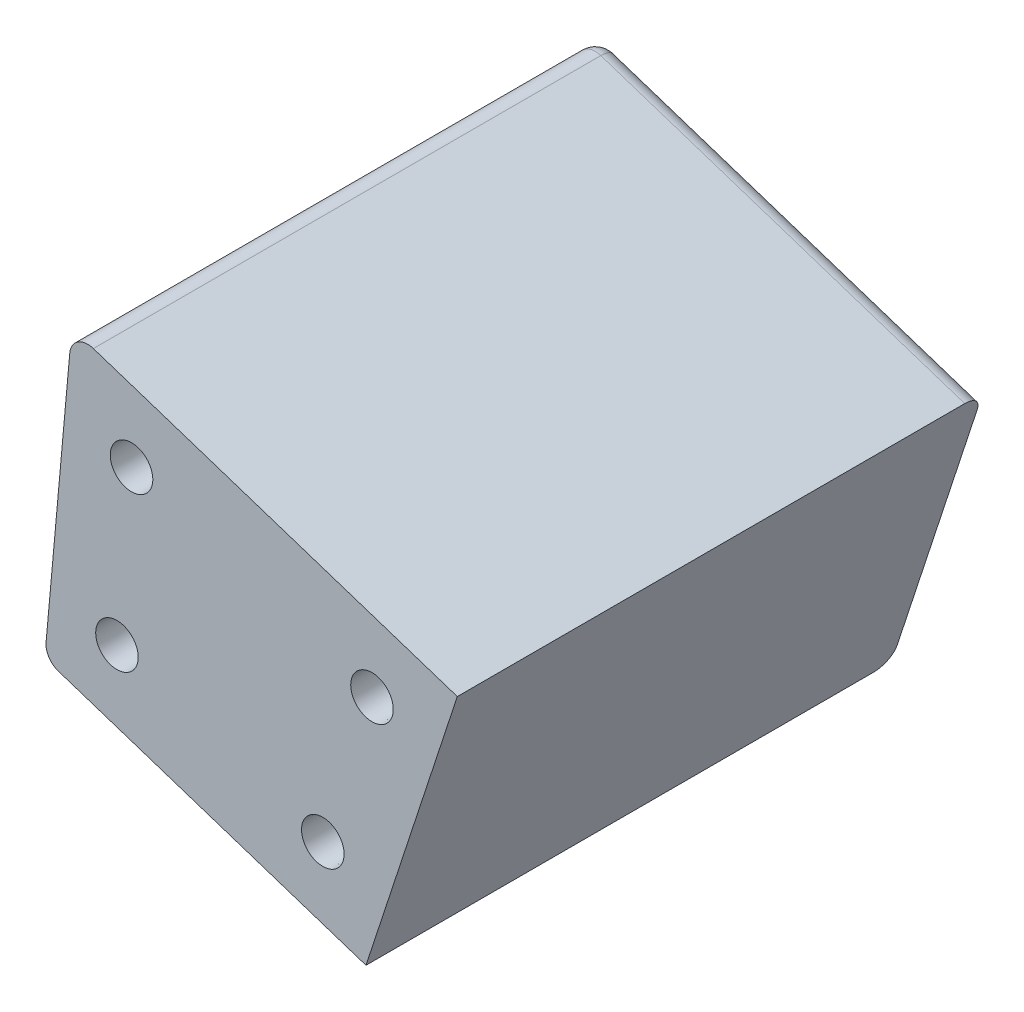
ISO-10303-21;
HEADER;
FILE_DESCRIPTION(('STEP AP214'),'2;1');
FILE_NAME('part.step','',(''),(''),'','','');
FILE_SCHEMA(('AUTOMOTIVE_DESIGN { 1 0 10303 214 1 1 1 1 }'));
ENDSEC;
DATA;
#1=APPLICATION_CONTEXT('core data for automotive mechanical design processes');
#2=APPLICATION_PROTOCOL_DEFINITION('international standard','automotive_design',2000,#1);
#3=PRODUCT_CONTEXT('',#1,'mechanical');
#4=PRODUCT('Part','Part','',(#3));
#5=PRODUCT_RELATED_PRODUCT_CATEGORY('part','',(#4));
#6=PRODUCT_DEFINITION_FORMATION('','',#4);
#7=PRODUCT_DEFINITION_CONTEXT('part definition',#1,'design');
#8=PRODUCT_DEFINITION('design','',#6,#7);
#9=PRODUCT_DEFINITION_SHAPE('','',#8);
#10=(LENGTH_UNIT() NAMED_UNIT(*) SI_UNIT(.MILLI.,.METRE.));
#11=(NAMED_UNIT(*) PLANE_ANGLE_UNIT() SI_UNIT($,.RADIAN.));
#12=(NAMED_UNIT(*) SI_UNIT($,.STERADIAN.) SOLID_ANGLE_UNIT());
#13=UNCERTAINTY_MEASURE_WITH_UNIT(LENGTH_MEASURE(1.E-05),#10,'distance_accuracy_value','');
#14=(GEOMETRIC_REPRESENTATION_CONTEXT(3) GLOBAL_UNCERTAINTY_ASSIGNED_CONTEXT((#13)) GLOBAL_UNIT_ASSIGNED_CONTEXT((#10,
#11,#12)) REPRESENTATION_CONTEXT('',''));
#15=CARTESIAN_POINT('',(0.,0.,0.));
#16=DIRECTION('',(0.,0.,1.));
#17=DIRECTION('',(1.,0.,0.));
#18=AXIS2_PLACEMENT_3D('',#15,#16,#17);
#19=CARTESIAN_POINT('',(322.852981493589,359.973302076131,-320.548936371749));
#20=DIRECTION('',(0.311692939950405,0.950182883020467,0.));
#21=DIRECTION('',(-0.950182883020467,0.311692939950405,0.));
#22=AXIS2_PLACEMENT_3D('',#19,#20,#21);
#23=PLANE('',#22);
#24=DIRECTION('',(0.950182883020467,-0.311692939950405,0.));
#25=VECTOR('',#24,1.);
#26=CARTESIAN_POINT('',(277.604402796012,374.81640520381,-71.4850000029993));
#27=LINE('',#26,#25);
#28=CARTESIAN_POINT('',(322.852981493589,359.973302076132,-71.4850000029993));
#29=VERTEX_POINT('',#28);
#30=CARTESIAN_POINT('',(279.524159161108,374.18665853491,-71.4850000029994));
#31=VERTEX_POINT('',#30);
#32=EDGE_CURVE('E178',#29,#31,#27,.F.);
#33=ORIENTED_EDGE('',*,*,#32,.F.);
#34=DIRECTION('',(0.,0.,1.));
#35=VECTOR('',#34,1.);
#36=CARTESIAN_POINT('',(322.852981493589,359.973302076131,-320.548936371749));
#37=LINE('',#36,#35);
#38=CARTESIAN_POINT('',(322.852981493587,359.973302076131,0.));
#39=VERTEX_POINT('',#38);
#40=EDGE_CURVE('E171',#29,#39,#37,.T.);
#41=ORIENTED_EDGE('',*,*,#40,.T.);
#42=DIRECTION('',(0.950182883020467,-0.311692939950405,0.));
#43=VECTOR('',#42,1.);
#44=CARTESIAN_POINT('',(322.852981493587,359.973302076131,0.));
#45=LINE('',#44,#43);
#46=CARTESIAN_POINT('',(279.524159161109,374.186658534908,0.));
#47=VERTEX_POINT('',#46);
#48=EDGE_CURVE('E172',#47,#39,#45,.T.);
#49=ORIENTED_EDGE('',*,*,#48,.F.);
#50=DIRECTION('',(0.,0.,1.));
#51=VECTOR('',#50,1.);
#52=CARTESIAN_POINT('',(279.524159161109,374.186658534908,-320.548936371748));
#53=LINE('',#52,#51);
#54=EDGE_CURVE('E185',#31,#47,#53,.T.);
#55=ORIENTED_EDGE('',*,*,#54,.F.);
#56=EDGE_LOOP('',(#33,#41,#49,#55));
#57=FACE_BOUND('',#56,.T.);
#58=ADVANCED_FACE('F35',(#57),#23,.F.);
#59=CARTESIAN_POINT('',(335.718107590044,399.1921005728,-320.548936371745));
#60=DIRECTION('',(-0.950182883020467,0.311692939950405,0.));
#61=DIRECTION('',(-0.311692939950405,-0.950182883020467,0.));
#62=AXIS2_PLACEMENT_3D('',#59,#60,#61);
#63=PLANE('',#62);
#64=DIRECTION('',(0.311692939950405,0.950182883020467,0.));
#65=VECTOR('',#64,1.);
#66=CARTESIAN_POINT('',(335.718107590041,399.1921005728,-74.0250000029995));
#67=LINE('',#66,#65);
#68=CARTESIAN_POINT('',(323.64468156106,362.386766599006,-74.0250000029995));
#69=VERTEX_POINT('',#68);
#70=CARTESIAN_POINT('',(334.926407522564,396.778636049931,-74.0250000029991));
#71=VERTEX_POINT('',#70);
#72=EDGE_CURVE('E163',#69,#71,#67,.T.);
#73=ORIENTED_EDGE('',*,*,#72,.T.);
#74=CARTESIAN_POINT('',(334.926407522567,396.778636049931,-71.4850000029991));
#75=DIRECTION('',(0.950182883020467,-0.311692939950405,0.));
#76=DIRECTION('',(-0.311692939950405,-0.950182883020467,0.));
#77=AXIS2_PLACEMENT_3D('',#74,#75,#76);
#78=CIRCLE('',#77,2.54);
#79=CARTESIAN_POINT('',(335.718107590046,399.192100572801,-71.4850000029995));
#80=VERTEX_POINT('',#79);
#81=EDGE_CURVE('E208',#80,#71,#78,.F.);
#82=ORIENTED_EDGE('',*,*,#81,.F.);
#83=DIRECTION('',(0.,0.,1.));
#84=VECTOR('',#83,1.);
#85=CARTESIAN_POINT('',(335.718107590044,399.1921005728,-320.548936371745));
#86=LINE('',#85,#84);
#87=CARTESIAN_POINT('',(335.718107590044,399.192100572799,4.16333634234434E-13));
#88=VERTEX_POINT('',#87);
#89=EDGE_CURVE('E167',#80,#88,#86,.T.);
#90=ORIENTED_EDGE('',*,*,#89,.T.);
#91=DIRECTION('',(0.311692939950405,0.950182883020467,0.));
#92=VECTOR('',#91,1.);
#93=CARTESIAN_POINT('',(335.718107590044,399.192100572799,4.16333634234434E-13));
#94=LINE('',#93,#92);
#95=EDGE_CURVE('E168',#39,#88,#94,.T.);
#96=ORIENTED_EDGE('',*,*,#95,.F.);
#97=ORIENTED_EDGE('',*,*,#40,.F.);
#98=CARTESIAN_POINT('',(323.644681561065,362.386766599006,-71.4850000029995));
#99=DIRECTION('',(0.950182883020467,-0.311692939950405,0.));
#100=DIRECTION('',(-0.311692939950405,-0.950182883020467,0.));
#101=AXIS2_PLACEMENT_3D('',#98,#99,#100);
#102=CIRCLE('',#101,2.54);
#103=EDGE_CURVE('E210',#69,#29,#102,.F.);
#104=ORIENTED_EDGE('',*,*,#103,.F.);
#105=EDGE_LOOP('',(#73,#82,#90,#96,#97,#104));
#106=FACE_BOUND('',#105,.T.);
#107=ADVANCED_FACE('F265',(#106),#63,.F.);
#108=CARTESIAN_POINT('',(281.415155825423,417.005352090966,-320.548936371747));
#109=DIRECTION('',(-0.311692939950405,-0.950182883020467,0.));
#110=DIRECTION('',(0.950182883020467,-0.311692939950405,0.));
#111=AXIS2_PLACEMENT_3D('',#108,#109,#110);
#112=PLANE('',#111);
#113=DIRECTION('',(0.,0.,1.));
#114=VECTOR('',#113,1.);
#115=CARTESIAN_POINT('',(284.449296568006,416.010048697085,-320.548936371747));
#116=LINE('',#115,#114);
#117=CARTESIAN_POINT('',(284.449296568005,416.010048697085,5.55111512312578E-13));
#118=VERTEX_POINT('',#117);
#119=CARTESIAN_POINT('',(284.449296568006,416.010048697086,-71.4850000029985));
#120=VERTEX_POINT('',#119);
#121=EDGE_CURVE('E44',#118,#120,#116,.F.);
#122=ORIENTED_EDGE('',*,*,#121,.F.);
#123=DIRECTION('',(-0.950182883020467,0.311692939950405,0.));
#124=VECTOR('',#123,1.);
#125=CARTESIAN_POINT('',(281.415155825424,417.005352090967,0.));
#126=LINE('',#125,#124);
#127=EDGE_CURVE('E164',#88,#118,#126,.T.);
#128=ORIENTED_EDGE('',*,*,#127,.F.);
#129=ORIENTED_EDGE('',*,*,#89,.F.);
#130=DIRECTION('',(-0.950182883020467,0.311692939950405,0.));
#131=VECTOR('',#130,1.);
#132=CARTESIAN_POINT('',(335.718107590046,399.192100572801,-71.4850000029995));
#133=LINE('',#132,#131);
#134=EDGE_CURVE('E11',#120,#80,#133,.F.);
#135=ORIENTED_EDGE('',*,*,#134,.F.);
#136=EDGE_LOOP('',(#122,#128,#129,#135));
#137=FACE_BOUND('',#136,.T.);
#138=ADVANCED_FACE('F270',(#137),#112,.F.);
#139=CARTESIAN_POINT('',(277.604402796012,374.816405203807,-320.548936371748));
#140=DIRECTION('',(0.995945412759858,-0.0899596287376289,0.));
#141=DIRECTION('',(0.0899596287376289,0.995945412759858,0.));
#142=AXIS2_PLACEMENT_3D('',#139,#140,#141);
#143=PLANE('',#142);
#144=DIRECTION('',(-0.0899596287376289,-0.995945412759858,0.));
#145=VECTOR('',#144,1.);
#146=CARTESIAN_POINT('',(277.60440279601,374.816405203807,5.82867087928207E-13));
#147=LINE('',#146,#145);
#148=CARTESIAN_POINT('',(281.127895152116,413.825081631207,5.55111512312578E-13));
#149=VERTEX_POINT('',#148);
#150=CARTESIAN_POINT('',(277.786157880173,376.828620514775,5.55111512312578E-13));
#151=VERTEX_POINT('',#150);
#152=EDGE_CURVE('E160',#149,#151,#147,.T.);
#153=ORIENTED_EDGE('',*,*,#152,.F.);
#154=DIRECTION('',(0.,0.,1.));
#155=VECTOR('',#154,1.);
#156=CARTESIAN_POINT('',(281.127895152116,413.825081631207,-320.548936371747));
#157=LINE('',#156,#155);
#158=CARTESIAN_POINT('',(281.127895152118,413.825081631208,-71.4850000029985));
#159=VERTEX_POINT('',#158);
#160=EDGE_CURVE('E192',#159,#149,#157,.T.);
#161=ORIENTED_EDGE('',*,*,#160,.F.);
#162=DIRECTION('',(-0.0899596287376289,-0.995945412759858,0.));
#163=VECTOR('',#162,1.);
#164=CARTESIAN_POINT('',(281.415155825424,417.005352090969,-71.4850000029985));
#165=LINE('',#164,#163);
#166=CARTESIAN_POINT('',(277.786157880175,376.828620514777,-71.4850000030002));
#167=VERTEX_POINT('',#166);
#168=EDGE_CURVE('E195',#167,#159,#165,.F.);
#169=ORIENTED_EDGE('',*,*,#168,.F.);
#170=DIRECTION('',(0.,0.,1.));
#171=VECTOR('',#170,1.);
#172=CARTESIAN_POINT('',(277.786157880174,376.828620514776,-320.548936371748));
#173=LINE('',#172,#171);
#174=EDGE_CURVE('E198',#151,#167,#173,.F.);
#175=ORIENTED_EDGE('',*,*,#174,.F.);
#176=EDGE_LOOP('',(#153,#161,#169,#175));
#177=FACE_BOUND('',#176,.T.);
#178=ADVANCED_FACE('F251',(#177),#143,.F.);
#179=CARTESIAN_POINT('',(0.,0.,0.));
#180=DIRECTION('',(0.,0.,-1.));
#181=DIRECTION('',(1.00000000000001,0.,0.));
#182=AXIS2_PLACEMENT_3D('',#179,#180,#181);
#183=PLANE('',#182);
#184=CARTESIAN_POINT('',(323.698740376241,393.110483865059,5.55111512312578E-13));
#185=DIRECTION('',(0.,0.,-1.));
#186=DIRECTION('',(-1.00000000000001,0.,0.));
#187=AXIS2_PLACEMENT_3D('',#184,#185,#186);
#188=CIRCLE('',#187,2.99720000000003);
#189=CARTESIAN_POINT('',(320.701540376241,393.110483865059,5.55111512312578E-13));
#190=VERTEX_POINT('',#189);
#191=EDGE_CURVE('E135',#190,#190,#188,.T.);
#192=ORIENTED_EDGE('',*,*,#191,.T.);
#193=EDGE_LOOP('',(#192));
#194=FACE_BOUND('',#193,.T.);
#195=CARTESIAN_POINT('',(289.824308357063,404.222472403145,5.55111512312578E-13));
#196=DIRECTION('',(0.,0.,-1.));
#197=DIRECTION('',(-1.00000000000001,0.,0.));
#198=AXIS2_PLACEMENT_3D('',#195,#196,#197);
#199=CIRCLE('',#198,2.99720000000003);
#200=CARTESIAN_POINT('',(286.827108357063,404.222472403145,5.55111512312578E-13));
#201=VERTEX_POINT('',#200);
#202=EDGE_CURVE('E141',#201,#201,#199,.T.);
#203=ORIENTED_EDGE('',*,*,#202,.T.);
#204=EDGE_LOOP('',(#203));
#205=FACE_BOUND('',#204,.T.);
#206=CARTESIAN_POINT('',(287.772364418152,381.505347156211,5.55111512312578E-13));
#207=DIRECTION('',(0.,0.,-1.));
#208=DIRECTION('',(-1.00000000000001,0.,0.));
#209=AXIS2_PLACEMENT_3D('',#206,#207,#208);
#210=CIRCLE('',#209,2.99720000000003);
#211=CARTESIAN_POINT('',(284.775164418151,381.505347156211,5.55111512312578E-13));
#212=VERTEX_POINT('',#211);
#213=EDGE_CURVE('E147',#212,#212,#210,.T.);
#214=ORIENTED_EDGE('',*,*,#213,.T.);
#215=EDGE_LOOP('',(#214));
#216=FACE_BOUND('',#215,.T.);
#217=CARTESIAN_POINT('',(316.771364785847,371.992669289927,5.55111512312578E-13));
#218=DIRECTION('',(0.,0.,-1.));
#219=DIRECTION('',(-1.00000000000001,0.,0.));
#220=AXIS2_PLACEMENT_3D('',#217,#218,#219);
#221=CIRCLE('',#220,2.99720000000003);
#222=CARTESIAN_POINT('',(313.774164785847,371.992669289927,5.55111512312578E-13));
#223=VERTEX_POINT('',#222);
#224=EDGE_CURVE('E153',#223,#223,#221,.T.);
#225=ORIENTED_EDGE('',*,*,#224,.T.);
#226=EDGE_LOOP('',(#225));
#227=FACE_BOUND('',#226,.T.);
#228=ORIENTED_EDGE('',*,*,#48,.T.);
#229=ORIENTED_EDGE('',*,*,#95,.T.);
#230=ORIENTED_EDGE('',*,*,#127,.T.);
#231=CARTESIAN_POINT('',(283.657596500527,413.596584174214,5.55111512312578E-13));
#232=DIRECTION('',(0.,0.,1.));
#233=DIRECTION('',(1.00000000000001,0.,0.));
#234=AXIS2_PLACEMENT_3D('',#231,#232,#233);
#235=CIRCLE('',#234,2.54);
#236=EDGE_CURVE('E188',#149,#118,#235,.F.);
#237=ORIENTED_EDGE('',*,*,#236,.F.);
#238=ORIENTED_EDGE('',*,*,#152,.T.);
#239=CARTESIAN_POINT('',(280.315859228582,376.600123057782,5.55111512312578E-13));
#240=DIRECTION('',(0.,0.,1.));
#241=DIRECTION('',(1.00000000000001,0.,0.));
#242=AXIS2_PLACEMENT_3D('',#239,#240,#241);
#243=CIRCLE('',#242,2.54);
#244=EDGE_CURVE('E190',#47,#151,#243,.F.);
#245=ORIENTED_EDGE('',*,*,#244,.F.);
#246=EDGE_LOOP('',(#228,#229,#230,#237,#238,#245));
#247=FACE_BOUND('',#246,.T.);
#248=ADVANCED_FACE('F247',(#194,#205,#216,#227,#247),#183,.F.);
#249=CARTESIAN_POINT('',(-313.774034821425,-375.700785936259,-74.0250000029981));
#250=DIRECTION('',(0.,0.,-1.));
#251=DIRECTION('',(0.,-1.00000000000001,0.));
#252=AXIS2_PLACEMENT_3D('',#249,#250,#251);
#253=PLANE('',#252);
#254=DIRECTION('',(-0.0899596287376289,-0.995945412759858,0.));
#255=VECTOR('',#254,1.);
#256=CARTESIAN_POINT('',(280.13410414442,374.587907746816,-74.0250000029994));
#257=LINE('',#256,#255);
#258=CARTESIAN_POINT('',(283.657596500524,413.596584174215,-74.0250000029984));
#259=VERTEX_POINT('',#258);
#260=CARTESIAN_POINT('',(280.315859228581,376.600123057783,-74.0250000029994));
#261=VERTEX_POINT('',#260);
#262=EDGE_CURVE('E203',#259,#261,#257,.T.);
#263=ORIENTED_EDGE('',*,*,#262,.F.);
#264=DIRECTION('',(-0.950182883020467,0.311692939950405,0.));
#265=VECTOR('',#264,1.);
#266=CARTESIAN_POINT('',(280.623455757947,414.591887568096,-74.0250000029996));
#267=LINE('',#266,#265);
#268=EDGE_CURVE('E201',#71,#259,#267,.T.);
#269=ORIENTED_EDGE('',*,*,#268,.F.);
#270=ORIENTED_EDGE('',*,*,#72,.F.);
#271=DIRECTION('',(0.950182883020467,-0.311692939950405,0.));
#272=VECTOR('',#271,1.);
#273=CARTESIAN_POINT('',(323.644681561062,362.386766599006,-74.0250000029995));
#274=LINE('',#273,#272);
#275=EDGE_CURVE('E206',#261,#69,#274,.T.);
#276=ORIENTED_EDGE('',*,*,#275,.F.);
#277=EDGE_LOOP('',(#263,#269,#270,#276));
#278=FACE_BOUND('',#277,.T.);
#279=ADVANCED_FACE('F250',(#278),#253,.T.);
#280=CARTESIAN_POINT('',(283.657596500526,413.596584174214,-320.548936371747));
#281=DIRECTION('',(0.,0.,1.));
#282=DIRECTION('',(-1.00000000000001,0.,0.));
#283=AXIS2_PLACEMENT_3D('',#280,#281,#282);
#284=CYLINDRICAL_SURFACE('',#283,2.54);
#285=ORIENTED_EDGE('',*,*,#236,.T.);
#286=ORIENTED_EDGE('',*,*,#121,.T.);
#287=CARTESIAN_POINT('',(283.657596500526,413.596584174216,-71.4850000029984));
#288=DIRECTION('',(0.,0.,1.));
#289=DIRECTION('',(1.00000000000001,0.,0.));
#290=AXIS2_PLACEMENT_3D('',#287,#288,#289);
#291=CIRCLE('',#290,2.54);
#292=EDGE_CURVE('E175',#120,#159,#291,.T.);
#293=ORIENTED_EDGE('',*,*,#292,.T.);
#294=ORIENTED_EDGE('',*,*,#160,.T.);
#295=EDGE_LOOP('',(#285,#286,#293,#294));
#296=FACE_BOUND('',#295,.T.);
#297=ADVANCED_FACE('F37',(#296),#284,.T.);
#298=CARTESIAN_POINT('',(-21.9695754547896,513.85289636188,-71.4850000029998));
#299=DIRECTION('',(0.950182883020467,-0.311692939950405,0.));
#300=DIRECTION('',(0.311692939950405,0.950182883020467,0.));
#301=AXIS2_PLACEMENT_3D('',#298,#299,#300);
#302=CYLINDRICAL_SURFACE('',#301,2.54);
#303=ORIENTED_EDGE('',*,*,#81,.T.);
#304=ORIENTED_EDGE('',*,*,#268,.T.);
#305=CARTESIAN_POINT('',(283.657596500528,413.596584174216,-71.4850000029984));
#306=DIRECTION('',(0.950182883020465,-0.311692939950412,0.));
#307=DIRECTION('',(-0.311692939950412,-0.950182883020465,0.));
#308=AXIS2_PLACEMENT_3D('',#305,#306,#307);
#309=CIRCLE('',#308,2.54);
#310=EDGE_CURVE('E51',#259,#120,#309,.T.);
#311=ORIENTED_EDGE('',*,*,#310,.T.);
#312=ORIENTED_EDGE('',*,*,#134,.T.);
#313=EDGE_LOOP('',(#303,#304,#311,#312));
#314=FACE_BOUND('',#313,.T.);
#315=ADVANCED_FACE('F290',(#314),#302,.T.);
#316=CARTESIAN_POINT('',(283.657596500526,413.596584174216,-71.4850000029984));
#317=DIRECTION('',(0.,0.,-1.));
#318=DIRECTION('',(1.00000000000001,0.,0.));
#319=AXIS2_PLACEMENT_3D('',#316,#317,#318);
#320=SPHERICAL_SURFACE('',#319,2.54);
#321=ORIENTED_EDGE('',*,*,#310,.F.);
#322=CARTESIAN_POINT('',(283.657596500526,413.596584174216,-71.4850000029984));
#323=DIRECTION('',(-0.0899596287376189,-0.995945412759858,0.));
#324=DIRECTION('',(-0.995945412759858,0.0899596287376189,0.));
#325=AXIS2_PLACEMENT_3D('',#322,#323,#324);
#326=CIRCLE('',#325,2.54);
#327=EDGE_CURVE('E220',#259,#159,#326,.F.);
#328=ORIENTED_EDGE('',*,*,#327,.T.);
#329=ORIENTED_EDGE('',*,*,#292,.F.);
#330=EDGE_LOOP('',(#321,#328,#329));
#331=FACE_BOUND('',#330,.T.);
#332=ADVANCED_FACE('F289',(#331),#320,.T.);
#333=CARTESIAN_POINT('',(208.105737921774,-422.840026702034,-71.4850000029983));
#334=DIRECTION('',(0.0899596287376289,0.995945412759858,0.));
#335=DIRECTION('',(-0.995945412759858,0.0899596287376289,0.));
#336=AXIS2_PLACEMENT_3D('',#333,#334,#335);
#337=CYLINDRICAL_SURFACE('',#336,2.54);
#338=ORIENTED_EDGE('',*,*,#327,.F.);
#339=ORIENTED_EDGE('',*,*,#262,.T.);
#340=CARTESIAN_POINT('',(280.315859228584,376.600123057784,-71.4850000029994));
#341=DIRECTION('',(0.0899596287376198,0.995945412759858,0.));
#342=DIRECTION('',(0.995945412759858,-0.0899596287376198,0.));
#343=AXIS2_PLACEMENT_3D('',#340,#341,#342);
#344=CIRCLE('',#343,2.54);
#345=EDGE_CURVE('E217',#261,#167,#344,.T.);
#346=ORIENTED_EDGE('',*,*,#345,.T.);
#347=ORIENTED_EDGE('',*,*,#168,.T.);
#348=EDGE_LOOP('',(#338,#339,#346,#347));
#349=FACE_BOUND('',#348,.T.);
#350=ADVANCED_FACE('F287',(#349),#337,.T.);
#351=CARTESIAN_POINT('',(-33.2513014162948,479.461026910959,-71.4850000029994));
#352=DIRECTION('',(-0.950182883020467,0.311692939950405,0.));
#353=DIRECTION('',(-0.311692939950405,-0.950182883020467,0.));
#354=AXIS2_PLACEMENT_3D('',#351,#352,#353);
#355=CYLINDRICAL_SURFACE('',#354,2.54);
#356=ORIENTED_EDGE('',*,*,#103,.T.);
#357=ORIENTED_EDGE('',*,*,#32,.T.);
#358=CARTESIAN_POINT('',(280.315859228584,376.600123057786,-71.4850000029994));
#359=DIRECTION('',(0.950182883020465,-0.311692939950412,0.));
#360=DIRECTION('',(-0.311692939950412,-0.950182883020465,0.));
#361=AXIS2_PLACEMENT_3D('',#358,#359,#360);
#362=CIRCLE('',#361,2.54);
#363=EDGE_CURVE('E215',#31,#261,#362,.T.);
#364=ORIENTED_EDGE('',*,*,#363,.T.);
#365=ORIENTED_EDGE('',*,*,#275,.T.);
#366=EDGE_LOOP('',(#356,#357,#364,#365));
#367=FACE_BOUND('',#366,.T.);
#368=ADVANCED_FACE('F281',(#367),#355,.T.);
#369=CARTESIAN_POINT('',(280.315859228584,376.600123057786,-71.4850000029994));
#370=DIRECTION('',(0.,0.,-1.));
#371=DIRECTION('',(1.00000000000001,0.,0.));
#372=AXIS2_PLACEMENT_3D('',#369,#370,#371);
#373=SPHERICAL_SURFACE('',#372,2.54);
#374=ORIENTED_EDGE('',*,*,#363,.F.);
#375=CARTESIAN_POINT('',(280.315859228584,376.600123057784,-71.4850000029994));
#376=DIRECTION('',(0.,0.,1.));
#377=DIRECTION('',(1.00000000000001,0.,0.));
#378=AXIS2_PLACEMENT_3D('',#375,#376,#377);
#379=CIRCLE('',#378,2.54);
#380=EDGE_CURVE('E159',#31,#167,#379,.F.);
#381=ORIENTED_EDGE('',*,*,#380,.T.);
#382=ORIENTED_EDGE('',*,*,#345,.F.);
#383=EDGE_LOOP('',(#374,#381,#382));
#384=FACE_BOUND('',#383,.T.);
#385=ADVANCED_FACE('F310',(#384),#373,.T.);
#386=CARTESIAN_POINT('',(280.315859228583,376.600123057783,-320.548936371748));
#387=DIRECTION('',(0.,0.,1.));
#388=DIRECTION('',(-1.00000000000001,0.,0.));
#389=AXIS2_PLACEMENT_3D('',#386,#387,#388);
#390=CYLINDRICAL_SURFACE('',#389,2.54);
#391=ORIENTED_EDGE('',*,*,#380,.F.);
#392=ORIENTED_EDGE('',*,*,#54,.T.);
#393=ORIENTED_EDGE('',*,*,#244,.T.);
#394=ORIENTED_EDGE('',*,*,#174,.T.);
#395=EDGE_LOOP('',(#391,#392,#393,#394));
#396=FACE_BOUND('',#395,.T.);
#397=ADVANCED_FACE('F278',(#396),#390,.T.);
#398=CARTESIAN_POINT('',(316.77136478585,371.992669289932,-4.6989999999994));
#399=DIRECTION('',(0.,0.,-1.));
#400=DIRECTION('',(1.00000000000001,0.,0.));
#401=AXIS2_PLACEMENT_3D('',#398,#399,#400);
#402=PLANE('',#401);
#403=CARTESIAN_POINT('',(316.77136478585,371.992669289932,-4.6989999999994));
#404=DIRECTION('',(0.,0.,1.));
#405=DIRECTION('',(1.00000000000001,0.,0.));
#406=AXIS2_PLACEMENT_3D('',#403,#404,#405);
#407=CIRCLE('',#406,2.45744999999997);
#408=CARTESIAN_POINT('',(319.22881478585,371.992669289932,-4.6989999999994));
#409=VERTEX_POINT('',#408);
#410=EDGE_CURVE('E134',#409,#409,#407,.T.);
#411=ORIENTED_EDGE('',*,*,#410,.F.);
#412=EDGE_LOOP('',(#411));
#413=FACE_BOUND('',#412,.T.);
#414=CARTESIAN_POINT('',(316.77136478585,371.992669289932,-4.6989999999994));
#415=DIRECTION('',(0.,0.,-1.));
#416=DIRECTION('',(-1.00000000000001,0.,0.));
#417=AXIS2_PLACEMENT_3D('',#414,#415,#416);
#418=CIRCLE('',#417,2.87019999999999);
#419=CARTESIAN_POINT('',(313.90116478585,371.992669289932,-4.6989999999994));
#420=VERTEX_POINT('',#419);
#421=EDGE_CURVE('E156',#420,#420,#418,.T.);
#422=ORIENTED_EDGE('',*,*,#421,.F.);
#423=EDGE_LOOP('',(#422));
#424=FACE_BOUND('',#423,.T.);
#425=ADVANCED_FACE('F309',(#413,#424),#402,.F.);
#426=CARTESIAN_POINT('',(316.771364785847,371.992669289927,5.55111512312578E-13));
#427=DIRECTION('',(0.,0.,1.));
#428=DIRECTION('',(-1.00000000000001,0.,0.));
#429=AXIS2_PLACEMENT_3D('',#426,#427,#428);
#430=CONICAL_SURFACE('',#429,2.99720000000003,0.0270204491872741);
#431=ORIENTED_EDGE('',*,*,#421,.T.);
#432=EDGE_LOOP('',(#431));
#433=FACE_BOUND('',#432,.T.);
#434=ORIENTED_EDGE('',*,*,#224,.F.);
#435=EDGE_LOOP('',(#434));
#436=FACE_BOUND('',#435,.T.);
#437=ADVANCED_FACE('F339',(#433,#436),#430,.F.);
#438=CARTESIAN_POINT('',(287.772364418151,381.505347156217,-4.69899999999945));
#439=DIRECTION('',(0.,0.,-1.));
#440=DIRECTION('',(1.00000000000001,0.,0.));
#441=AXIS2_PLACEMENT_3D('',#438,#439,#440);
#442=PLANE('',#441);
#443=CARTESIAN_POINT('',(287.772364418151,381.505347156217,-4.69899999999945));
#444=DIRECTION('',(0.,0.,1.));
#445=DIRECTION('',(1.00000000000001,0.,0.));
#446=AXIS2_PLACEMENT_3D('',#443,#444,#445);
#447=CIRCLE('',#446,2.45744999999997);
#448=CARTESIAN_POINT('',(290.229814418151,381.505347156217,-4.69899999999945));
#449=VERTEX_POINT('',#448);
#450=EDGE_CURVE('E130',#449,#449,#447,.T.);
#451=ORIENTED_EDGE('',*,*,#450,.F.);
#452=EDGE_LOOP('',(#451));
#453=FACE_BOUND('',#452,.T.);
#454=CARTESIAN_POINT('',(287.772364418151,381.505347156217,-4.69899999999945));
#455=DIRECTION('',(0.,0.,-1.));
#456=DIRECTION('',(-1.00000000000001,0.,0.));
#457=AXIS2_PLACEMENT_3D('',#454,#455,#456);
#458=CIRCLE('',#457,2.87019999999999);
#459=CARTESIAN_POINT('',(284.902164418151,381.505347156217,-4.69899999999945));
#460=VERTEX_POINT('',#459);
#461=EDGE_CURVE('E150',#460,#460,#458,.T.);
#462=ORIENTED_EDGE('',*,*,#461,.F.);
#463=EDGE_LOOP('',(#462));
#464=FACE_BOUND('',#463,.T.);
#465=ADVANCED_FACE('F347',(#453,#464),#442,.F.);
#466=CARTESIAN_POINT('',(287.772364418152,381.505347156211,5.55111512312578E-13));
#467=DIRECTION('',(0.,0.,1.));
#468=DIRECTION('',(-1.00000000000001,0.,0.));
#469=AXIS2_PLACEMENT_3D('',#466,#467,#468);
#470=CONICAL_SURFACE('',#469,2.99720000000003,0.0270204491872741);
#471=ORIENTED_EDGE('',*,*,#461,.T.);
#472=EDGE_LOOP('',(#471));
#473=FACE_BOUND('',#472,.T.);
#474=ORIENTED_EDGE('',*,*,#213,.F.);
#475=EDGE_LOOP('',(#474));
#476=FACE_BOUND('',#475,.T.);
#477=ADVANCED_FACE('F237',(#473,#476),#470,.F.);
#478=CARTESIAN_POINT('',(289.824308357063,404.222472403151,-4.69899999999945));
#479=DIRECTION('',(0.,0.,-1.));
#480=DIRECTION('',(1.00000000000001,0.,0.));
#481=AXIS2_PLACEMENT_3D('',#478,#479,#480);
#482=PLANE('',#481);
#483=CARTESIAN_POINT('',(289.824308357063,404.222472403151,-4.69899999999945));
#484=DIRECTION('',(0.,0.,1.));
#485=DIRECTION('',(1.00000000000001,0.,0.));
#486=AXIS2_PLACEMENT_3D('',#483,#484,#485);
#487=CIRCLE('',#486,2.45744999999997);
#488=CARTESIAN_POINT('',(292.281758357063,404.222472403151,-4.69899999999945));
#489=VERTEX_POINT('',#488);
#490=EDGE_CURVE('E126',#489,#489,#487,.T.);
#491=ORIENTED_EDGE('',*,*,#490,.F.);
#492=EDGE_LOOP('',(#491));
#493=FACE_BOUND('',#492,.T.);
#494=CARTESIAN_POINT('',(289.824308357063,404.222472403151,-4.69899999999945));
#495=DIRECTION('',(0.,0.,-1.));
#496=DIRECTION('',(-1.00000000000001,0.,0.));
#497=AXIS2_PLACEMENT_3D('',#494,#495,#496);
#498=CIRCLE('',#497,2.87019999999999);
#499=CARTESIAN_POINT('',(286.954108357063,404.222472403151,-4.69899999999945));
#500=VERTEX_POINT('',#499);
#501=EDGE_CURVE('E144',#500,#500,#498,.T.);
#502=ORIENTED_EDGE('',*,*,#501,.F.);
#503=EDGE_LOOP('',(#502));
#504=FACE_BOUND('',#503,.T.);
#505=ADVANCED_FACE('F233',(#493,#504),#482,.F.);
#506=CARTESIAN_POINT('',(289.824308357063,404.222472403145,5.55111512312578E-13));
#507=DIRECTION('',(0.,0.,1.));
#508=DIRECTION('',(-1.00000000000001,0.,0.));
#509=AXIS2_PLACEMENT_3D('',#506,#507,#508);
#510=CONICAL_SURFACE('',#509,2.99720000000003,0.0270204491872741);
#511=ORIENTED_EDGE('',*,*,#501,.T.);
#512=EDGE_LOOP('',(#511));
#513=FACE_BOUND('',#512,.T.);
#514=ORIENTED_EDGE('',*,*,#202,.F.);
#515=EDGE_LOOP('',(#514));
#516=FACE_BOUND('',#515,.T.);
#517=ADVANCED_FACE('F236',(#513,#516),#510,.F.);
#518=CARTESIAN_POINT('',(323.698740376242,393.110483865064,-4.69899999999945));
#519=DIRECTION('',(0.,0.,-1.));
#520=DIRECTION('',(1.00000000000001,0.,0.));
#521=AXIS2_PLACEMENT_3D('',#518,#519,#520);
#522=PLANE('',#521);
#523=CARTESIAN_POINT('',(323.698740376242,393.110483865064,-4.69899999999945));
#524=DIRECTION('',(0.,0.,1.));
#525=DIRECTION('',(1.00000000000001,0.,0.));
#526=AXIS2_PLACEMENT_3D('',#523,#524,#525);
#527=CIRCLE('',#526,2.45744999999997);
#528=CARTESIAN_POINT('',(326.156190376242,393.110483865064,-4.69899999999945));
#529=VERTEX_POINT('',#528);
#530=EDGE_CURVE('E39',#529,#529,#527,.T.);
#531=ORIENTED_EDGE('',*,*,#530,.F.);
#532=EDGE_LOOP('',(#531));
#533=FACE_BOUND('',#532,.T.);
#534=CARTESIAN_POINT('',(323.698740376242,393.110483865064,-4.69899999999945));
#535=DIRECTION('',(0.,0.,-1.));
#536=DIRECTION('',(-1.00000000000001,0.,0.));
#537=AXIS2_PLACEMENT_3D('',#534,#535,#536);
#538=CIRCLE('',#537,2.87019999999999);
#539=CARTESIAN_POINT('',(320.828540376242,393.110483865064,-4.69899999999945));
#540=VERTEX_POINT('',#539);
#541=EDGE_CURVE('E138',#540,#540,#538,.T.);
#542=ORIENTED_EDGE('',*,*,#541,.F.);
#543=EDGE_LOOP('',(#542));
#544=FACE_BOUND('',#543,.T.);
#545=ADVANCED_FACE('F243',(#533,#544),#522,.F.);
#546=CARTESIAN_POINT('',(323.698740376241,393.110483865059,5.55111512312578E-13));
#547=DIRECTION('',(0.,0.,1.));
#548=DIRECTION('',(-1.00000000000001,0.,0.));
#549=AXIS2_PLACEMENT_3D('',#546,#547,#548);
#550=CONICAL_SURFACE('',#549,2.99720000000003,0.0270204491872741);
#551=ORIENTED_EDGE('',*,*,#541,.T.);
#552=EDGE_LOOP('',(#551));
#553=FACE_BOUND('',#552,.T.);
#554=ORIENTED_EDGE('',*,*,#191,.F.);
#555=EDGE_LOOP('',(#554));
#556=FACE_BOUND('',#555,.T.);
#557=ADVANCED_FACE('F377',(#553,#556),#550,.F.);
#558=CARTESIAN_POINT('',(316.771364785847,371.992669289927,5.55111512312578E-13));
#559=DIRECTION('',(0.,0.,1.));
#560=DIRECTION('',(-1.00000000000001,0.,0.));
#561=AXIS2_PLACEMENT_3D('',#558,#559,#560);
#562=CYLINDRICAL_SURFACE('',#561,2.45744999999997);
#563=CARTESIAN_POINT('',(316.771364785846,371.992669289929,-12.6999999999994));
#564=DIRECTION('',(0.,0.,-1.));
#565=DIRECTION('',(-1.00000000000001,0.,0.));
#566=AXIS2_PLACEMENT_3D('',#563,#564,#565);
#567=CIRCLE('',#566,2.45744999999997);
#568=CARTESIAN_POINT('',(314.313914785846,371.992669289929,-12.6999999999994));
#569=VERTEX_POINT('',#568);
#570=EDGE_CURVE('E131',#569,#569,#567,.T.);
#571=ORIENTED_EDGE('',*,*,#570,.T.);
#572=EDGE_LOOP('',(#571));
#573=FACE_BOUND('',#572,.T.);
#574=ORIENTED_EDGE('',*,*,#410,.T.);
#575=EDGE_LOOP('',(#574));
#576=FACE_BOUND('',#575,.T.);
#577=ADVANCED_FACE('F385',(#573,#576),#562,.F.);
#578=CARTESIAN_POINT('',(316.771364785846,371.992669289929,-12.6999999999994));
#579=DIRECTION('',(0.,0.,1.));
#580=DIRECTION('',(-1.00000000000001,0.,0.));
#581=AXIS2_PLACEMENT_3D('',#578,#579,#580);
#582=CONICAL_SURFACE('',#581,2.45744999999997,1.02974425867665);
#583=CARTESIAN_POINT('',(316.771364785846,371.992669289929,-14.1765849282287));
#584=VERTEX_POINT('',#583);
#585=VERTEX_LOOP('',#584);
#586=FACE_BOUND('',#585,.T.);
#587=ORIENTED_EDGE('',*,*,#570,.F.);
#588=EDGE_LOOP('',(#587));
#589=FACE_BOUND('',#588,.T.);
#590=ADVANCED_FACE('F393',(#586,#589),#582,.F.);
#591=CARTESIAN_POINT('',(287.772364418152,381.505347156211,5.55111512312578E-13));
#592=DIRECTION('',(0.,0.,1.));
#593=DIRECTION('',(-1.00000000000001,0.,0.));
#594=AXIS2_PLACEMENT_3D('',#591,#592,#593);
#595=CYLINDRICAL_SURFACE('',#594,2.45744999999997);
#596=CARTESIAN_POINT('',(287.77236441815,381.505347156214,-12.6999999999994));
#597=DIRECTION('',(0.,0.,-1.));
#598=DIRECTION('',(-1.00000000000001,0.,0.));
#599=AXIS2_PLACEMENT_3D('',#596,#597,#598);
#600=CIRCLE('',#599,2.45744999999997);
#601=CARTESIAN_POINT('',(285.31491441815,381.505347156214,-12.6999999999994));
#602=VERTEX_POINT('',#601);
#603=EDGE_CURVE('E127',#602,#602,#600,.T.);
#604=ORIENTED_EDGE('',*,*,#603,.T.);
#605=EDGE_LOOP('',(#604));
#606=FACE_BOUND('',#605,.T.);
#607=ORIENTED_EDGE('',*,*,#450,.T.);
#608=EDGE_LOOP('',(#607));
#609=FACE_BOUND('',#608,.T.);
#610=ADVANCED_FACE('F401',(#606,#609),#595,.F.);
#611=CARTESIAN_POINT('',(287.77236441815,381.505347156214,-12.6999999999994));
#612=DIRECTION('',(0.,0.,1.));
#613=DIRECTION('',(-1.00000000000001,0.,0.));
#614=AXIS2_PLACEMENT_3D('',#611,#612,#613);
#615=CONICAL_SURFACE('',#614,2.45744999999997,1.02974425867665);
#616=CARTESIAN_POINT('',(287.77236441815,381.505347156214,-14.1765849282287));
#617=VERTEX_POINT('',#616);
#618=VERTEX_LOOP('',#617);
#619=FACE_BOUND('',#618,.T.);
#620=ORIENTED_EDGE('',*,*,#603,.F.);
#621=EDGE_LOOP('',(#620));
#622=FACE_BOUND('',#621,.T.);
#623=ADVANCED_FACE('F409',(#619,#622),#615,.F.);
#624=CARTESIAN_POINT('',(289.824308357063,404.222472403145,5.55111512312578E-13));
#625=DIRECTION('',(0.,0.,1.));
#626=DIRECTION('',(-1.00000000000001,0.,0.));
#627=AXIS2_PLACEMENT_3D('',#624,#625,#626);
#628=CYLINDRICAL_SURFACE('',#627,2.45744999999997);
#629=CARTESIAN_POINT('',(289.824308357061,404.222472403149,-12.6999999999994));
#630=DIRECTION('',(0.,0.,-1.));
#631=DIRECTION('',(-1.00000000000001,0.,0.));
#632=AXIS2_PLACEMENT_3D('',#629,#630,#631);
#633=CIRCLE('',#632,2.45744999999997);
#634=CARTESIAN_POINT('',(287.366858357061,404.222472403149,-12.6999999999994));
#635=VERTEX_POINT('',#634);
#636=EDGE_CURVE('E122',#635,#635,#633,.T.);
#637=ORIENTED_EDGE('',*,*,#636,.T.);
#638=EDGE_LOOP('',(#637));
#639=FACE_BOUND('',#638,.T.);
#640=ORIENTED_EDGE('',*,*,#490,.T.);
#641=EDGE_LOOP('',(#640));
#642=FACE_BOUND('',#641,.T.);
#643=ADVANCED_FACE('F231',(#639,#642),#628,.F.);
#644=CARTESIAN_POINT('',(289.824308357061,404.222472403149,-12.6999999999994));
#645=DIRECTION('',(0.,0.,1.));
#646=DIRECTION('',(-1.00000000000001,0.,0.));
#647=AXIS2_PLACEMENT_3D('',#644,#645,#646);
#648=CONICAL_SURFACE('',#647,2.45744999999997,1.02974425867665);
#649=CARTESIAN_POINT('',(289.824308357061,404.222472403149,-14.1765849282288));
#650=VERTEX_POINT('',#649);
#651=VERTEX_LOOP('',#650);
#652=FACE_BOUND('',#651,.T.);
#653=ORIENTED_EDGE('',*,*,#636,.F.);
#654=EDGE_LOOP('',(#653));
#655=FACE_BOUND('',#654,.T.);
#656=ADVANCED_FACE('F424',(#652,#655),#648,.F.);
#657=CARTESIAN_POINT('',(323.698740376241,393.110483865059,5.55111512312578E-13));
#658=DIRECTION('',(0.,0.,1.));
#659=DIRECTION('',(-1.00000000000001,0.,0.));
#660=AXIS2_PLACEMENT_3D('',#657,#658,#659);
#661=CYLINDRICAL_SURFACE('',#660,2.45744999999997);
#662=CARTESIAN_POINT('',(323.698740376241,393.110483865063,-12.6999999999995));
#663=DIRECTION('',(0.,0.,-1.));
#664=DIRECTION('',(-1.00000000000001,0.,0.));
#665=AXIS2_PLACEMENT_3D('',#662,#663,#664);
#666=CIRCLE('',#665,2.45744999999997);
#667=CARTESIAN_POINT('',(321.241290376241,393.110483865063,-12.6999999999995));
#668=VERTEX_POINT('',#667);
#669=EDGE_CURVE('E118',#668,#668,#666,.T.);
#670=ORIENTED_EDGE('',*,*,#669,.T.);
#671=EDGE_LOOP('',(#670));
#672=FACE_BOUND('',#671,.T.);
#673=ORIENTED_EDGE('',*,*,#530,.T.);
#674=EDGE_LOOP('',(#673));
#675=FACE_BOUND('',#674,.T.);
#676=ADVANCED_FACE('F114',(#672,#675),#661,.F.);
#677=CARTESIAN_POINT('',(323.698740376241,393.110483865063,-12.6999999999995));
#678=DIRECTION('',(0.,0.,1.));
#679=DIRECTION('',(-1.00000000000001,0.,0.));
#680=AXIS2_PLACEMENT_3D('',#677,#678,#679);
#681=CONICAL_SURFACE('',#680,2.45744999999997,1.02974425867665);
#682=CARTESIAN_POINT('',(323.698740376241,393.110483865063,-14.1765849282288));
#683=VERTEX_POINT('',#682);
#684=VERTEX_LOOP('',#683);
#685=FACE_BOUND('',#684,.T.);
#686=ORIENTED_EDGE('',*,*,#669,.F.);
#687=EDGE_LOOP('',(#686));
#688=FACE_BOUND('',#687,.T.);
#689=ADVANCED_FACE('F111',(#685,#688),#681,.F.);
#690=CLOSED_SHELL('',(#58,#107,#138,#178,#248,#279,#297,#315,#332,#350,#368,#385,#397,#425,#437,
#465,#477,#505,#517,#545,#557,#577,#590,#610,#623,#643,#656,#676,#689));
#691=MANIFOLD_SOLID_BREP('B2',#690);
#692=ADVANCED_BREP_SHAPE_REPRESENTATION('',(#18,#691),#14);
#693=SHAPE_DEFINITION_REPRESENTATION(#9,#692);
ENDSEC;
END-ISO-10303-21;
